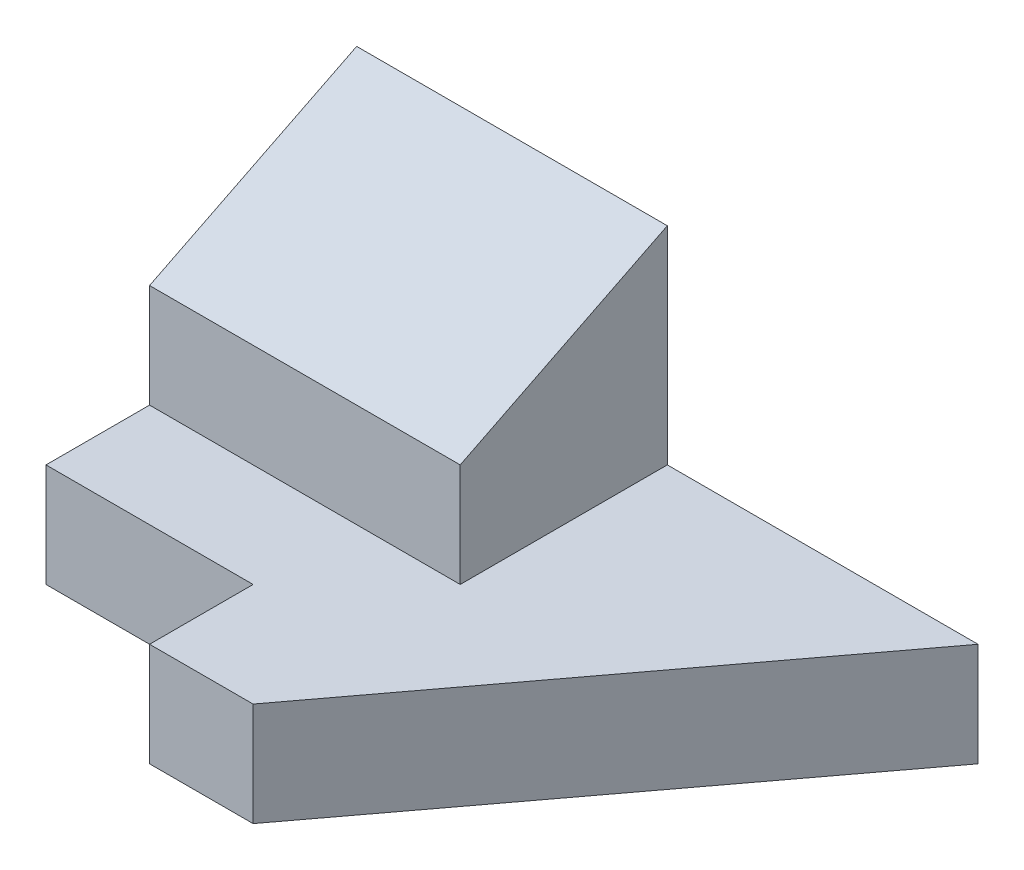
ISO-10303-21;
HEADER;
FILE_DESCRIPTION(('STEP AP214'),'2;1');
FILE_NAME('part.step','',(''),(''),'','','');
FILE_SCHEMA(('AUTOMOTIVE_DESIGN { 1 0 10303 214 1 1 1 1 }'));
ENDSEC;
DATA;
#1=APPLICATION_CONTEXT('core data for automotive mechanical design processes');
#2=APPLICATION_PROTOCOL_DEFINITION('international standard','automotive_design',2000,#1);
#3=PRODUCT_CONTEXT('',#1,'mechanical');
#4=PRODUCT('Part','Part','',(#3));
#5=PRODUCT_RELATED_PRODUCT_CATEGORY('part','',(#4));
#6=PRODUCT_DEFINITION_FORMATION('','',#4);
#7=PRODUCT_DEFINITION_CONTEXT('part definition',#1,'design');
#8=PRODUCT_DEFINITION('design','',#6,#7);
#9=PRODUCT_DEFINITION_SHAPE('','',#8);
#10=(LENGTH_UNIT() NAMED_UNIT(*) SI_UNIT(.MILLI.,.METRE.));
#11=(NAMED_UNIT(*) PLANE_ANGLE_UNIT() SI_UNIT($,.RADIAN.));
#12=(NAMED_UNIT(*) SI_UNIT($,.STERADIAN.) SOLID_ANGLE_UNIT());
#13=UNCERTAINTY_MEASURE_WITH_UNIT(LENGTH_MEASURE(1.E-05),#10,'distance_accuracy_value','');
#14=(GEOMETRIC_REPRESENTATION_CONTEXT(3) GLOBAL_UNCERTAINTY_ASSIGNED_CONTEXT((#13)) GLOBAL_UNIT_ASSIGNED_CONTEXT((#10,
#11,#12)) REPRESENTATION_CONTEXT('',''));
#15=CARTESIAN_POINT('',(0.,0.,0.));
#16=DIRECTION('',(0.,0.,1.));
#17=DIRECTION('',(1.,0.,0.));
#18=AXIS2_PLACEMENT_3D('',#15,#16,#17);
#19=CARTESIAN_POINT('',(0.,5.,-10.));
#20=DIRECTION('',(0.,0.,-1.));
#21=DIRECTION('',(-1.,0.,0.));
#22=AXIS2_PLACEMENT_3D('',#19,#20,#21);
#23=PLANE('',#22);
#24=DIRECTION('',(0.,-1.,0.));
#25=VECTOR('',#24,1.);
#26=CARTESIAN_POINT('',(15.,5.,-10.));
#27=LINE('',#26,#25);
#28=CARTESIAN_POINT('',(15.,5.,-10.));
#29=VERTEX_POINT('',#28);
#30=CARTESIAN_POINT('',(15.,0.,-10.));
#31=VERTEX_POINT('',#30);
#32=EDGE_CURVE('E137',#29,#31,#27,.T.);
#33=ORIENTED_EDGE('',*,*,#32,.T.);
#34=DIRECTION('',(1.,0.,0.));
#35=VECTOR('',#34,1.);
#36=CARTESIAN_POINT('',(0.,0.,-10.));
#37=LINE('',#36,#35);
#38=CARTESIAN_POINT('',(-15.,0.,-10.));
#39=VERTEX_POINT('',#38);
#40=EDGE_CURVE('E90',#39,#31,#37,.T.);
#41=ORIENTED_EDGE('',*,*,#40,.F.);
#42=DIRECTION('',(0.,-1.,0.));
#43=VECTOR('',#42,1.);
#44=CARTESIAN_POINT('',(-15.,5.,-10.));
#45=LINE('',#44,#43);
#46=CARTESIAN_POINT('',(-15.,15.,-10.));
#47=VERTEX_POINT('',#46);
#48=EDGE_CURVE('E11',#47,#39,#45,.T.);
#49=ORIENTED_EDGE('',*,*,#48,.F.);
#50=DIRECTION('',(1.,0.,0.));
#51=VECTOR('',#50,1.);
#52=CARTESIAN_POINT('',(0.,15.,-10.));
#53=LINE('',#52,#51);
#54=CARTESIAN_POINT('',(0.,15.,-10.));
#55=VERTEX_POINT('',#54);
#56=EDGE_CURVE('E180',#47,#55,#53,.T.);
#57=ORIENTED_EDGE('',*,*,#56,.T.);
#58=DIRECTION('',(0.,-1.,0.));
#59=VECTOR('',#58,1.);
#60=CARTESIAN_POINT('',(0.,15.,-10.));
#61=LINE('',#60,#59);
#62=CARTESIAN_POINT('',(0.,5.,-10.));
#63=VERTEX_POINT('',#62);
#64=EDGE_CURVE('E174',#55,#63,#61,.T.);
#65=ORIENTED_EDGE('',*,*,#64,.T.);
#66=DIRECTION('',(1.,0.,0.));
#67=VECTOR('',#66,1.);
#68=CARTESIAN_POINT('',(0.,5.,-10.));
#69=LINE('',#68,#67);
#70=EDGE_CURVE('E62',#63,#29,#69,.T.);
#71=ORIENTED_EDGE('',*,*,#70,.T.);
#72=EDGE_LOOP('',(#33,#41,#49,#57,#65,#71));
#73=FACE_BOUND('',#72,.T.);
#74=ADVANCED_FACE('F39',(#73),#23,.T.);
#75=CARTESIAN_POINT('',(-15.,5.,0.));
#76=DIRECTION('',(-1.,0.,0.));
#77=DIRECTION('',(0.,0.,1.));
#78=AXIS2_PLACEMENT_3D('',#75,#76,#77);
#79=PLANE('',#78);
#80=DIRECTION('',(0.,0.447213595499958,-0.894427190999916));
#81=VECTOR('',#80,1.);
#82=CARTESIAN_POINT('',(-15.,15.,-10.));
#83=LINE('',#82,#81);
#84=CARTESIAN_POINT('',(-15.,10.,0.));
#85=VERTEX_POINT('',#84);
#86=EDGE_CURVE('E162',#85,#47,#83,.T.);
#87=ORIENTED_EDGE('',*,*,#86,.T.);
#88=ORIENTED_EDGE('',*,*,#48,.T.);
#89=DIRECTION('',(0.,0.,-1.));
#90=VECTOR('',#89,1.);
#91=CARTESIAN_POINT('',(-15.,0.,0.));
#92=LINE('',#91,#90);
#93=CARTESIAN_POINT('',(-15.,0.,5.));
#94=VERTEX_POINT('',#93);
#95=EDGE_CURVE('E139',#94,#39,#92,.T.);
#96=ORIENTED_EDGE('',*,*,#95,.F.);
#97=DIRECTION('',(0.,-1.,0.));
#98=VECTOR('',#97,1.);
#99=CARTESIAN_POINT('',(-15.,5.,5.));
#100=LINE('',#99,#98);
#101=CARTESIAN_POINT('',(-15.,5.,5.));
#102=VERTEX_POINT('',#101);
#103=EDGE_CURVE('E46',#102,#94,#100,.T.);
#104=ORIENTED_EDGE('',*,*,#103,.F.);
#105=DIRECTION('',(0.,0.,-1.));
#106=VECTOR('',#105,1.);
#107=CARTESIAN_POINT('',(-15.,5.,0.));
#108=LINE('',#107,#106);
#109=CARTESIAN_POINT('',(-15.,5.,0.));
#110=VERTEX_POINT('',#109);
#111=EDGE_CURVE('E132',#102,#110,#108,.T.);
#112=ORIENTED_EDGE('',*,*,#111,.T.);
#113=DIRECTION('',(0.,-1.,0.));
#114=VECTOR('',#113,1.);
#115=CARTESIAN_POINT('',(-15.,15.,0.));
#116=LINE('',#115,#114);
#117=EDGE_CURVE('E53',#85,#110,#116,.T.);
#118=ORIENTED_EDGE('',*,*,#117,.F.);
#119=EDGE_LOOP('',(#87,#88,#96,#104,#112,#118));
#120=FACE_BOUND('',#119,.T.);
#121=ADVANCED_FACE('F158',(#120),#79,.T.);
#122=CARTESIAN_POINT('',(0.,5.,5.));
#123=DIRECTION('',(0.,0.,-1.));
#124=DIRECTION('',(-1.,0.,0.));
#125=AXIS2_PLACEMENT_3D('',#122,#123,#124);
#126=PLANE('',#125);
#127=DIRECTION('',(1.,0.,0.));
#128=VECTOR('',#127,1.);
#129=CARTESIAN_POINT('',(0.,0.,5.));
#130=LINE('',#129,#128);
#131=CARTESIAN_POINT('',(-5.,0.,5.));
#132=VERTEX_POINT('',#131);
#133=EDGE_CURVE('E142',#94,#132,#130,.T.);
#134=ORIENTED_EDGE('',*,*,#133,.T.);
#135=DIRECTION('',(0.,-1.,0.));
#136=VECTOR('',#135,1.);
#137=CARTESIAN_POINT('',(-5.,5.,5.));
#138=LINE('',#137,#136);
#139=CARTESIAN_POINT('',(-5.,5.,5.));
#140=VERTEX_POINT('',#139);
#141=EDGE_CURVE('E115',#140,#132,#138,.T.);
#142=ORIENTED_EDGE('',*,*,#141,.F.);
#143=DIRECTION('',(1.,0.,0.));
#144=VECTOR('',#143,1.);
#145=CARTESIAN_POINT('',(0.,5.,5.));
#146=LINE('',#145,#144);
#147=EDGE_CURVE('E129',#102,#140,#146,.T.);
#148=ORIENTED_EDGE('',*,*,#147,.F.);
#149=ORIENTED_EDGE('',*,*,#103,.T.);
#150=EDGE_LOOP('',(#134,#142,#148,#149));
#151=FACE_BOUND('',#150,.T.);
#152=ADVANCED_FACE('F155',(#151),#126,.F.);
#153=CARTESIAN_POINT('',(-5.,5.,0.));
#154=DIRECTION('',(-1.,0.,0.));
#155=DIRECTION('',(0.,0.,1.));
#156=AXIS2_PLACEMENT_3D('',#153,#154,#155);
#157=PLANE('',#156);
#158=DIRECTION('',(0.,0.,-1.));
#159=VECTOR('',#158,1.);
#160=CARTESIAN_POINT('',(-5.,0.,0.));
#161=LINE('',#160,#159);
#162=CARTESIAN_POINT('',(-5.,0.,10.));
#163=VERTEX_POINT('',#162);
#164=EDGE_CURVE('E112',#163,#132,#161,.T.);
#165=ORIENTED_EDGE('',*,*,#164,.F.);
#166=DIRECTION('',(0.,-1.,0.));
#167=VECTOR('',#166,1.);
#168=CARTESIAN_POINT('',(-5.,5.,10.));
#169=LINE('',#168,#167);
#170=CARTESIAN_POINT('',(-5.,5.,10.));
#171=VERTEX_POINT('',#170);
#172=EDGE_CURVE('E106',#171,#163,#169,.T.);
#173=ORIENTED_EDGE('',*,*,#172,.F.);
#174=DIRECTION('',(0.,0.,-1.));
#175=VECTOR('',#174,1.);
#176=CARTESIAN_POINT('',(-5.,5.,0.));
#177=LINE('',#176,#175);
#178=EDGE_CURVE('E110',#171,#140,#177,.T.);
#179=ORIENTED_EDGE('',*,*,#178,.T.);
#180=ORIENTED_EDGE('',*,*,#141,.T.);
#181=EDGE_LOOP('',(#165,#173,#179,#180));
#182=FACE_BOUND('',#181,.T.);
#183=ADVANCED_FACE('F108',(#182),#157,.T.);
#184=CARTESIAN_POINT('',(0.,5.,10.));
#185=DIRECTION('',(0.,0.,-1.));
#186=DIRECTION('',(-1.,0.,0.));
#187=AXIS2_PLACEMENT_3D('',#184,#185,#186);
#188=PLANE('',#187);
#189=DIRECTION('',(1.,0.,0.));
#190=VECTOR('',#189,1.);
#191=CARTESIAN_POINT('',(0.,0.,10.));
#192=LINE('',#191,#190);
#193=CARTESIAN_POINT('',(0.,0.,10.));
#194=VERTEX_POINT('',#193);
#195=EDGE_CURVE('E146',#163,#194,#192,.T.);
#196=ORIENTED_EDGE('',*,*,#195,.T.);
#197=DIRECTION('',(0.,-1.,0.));
#198=VECTOR('',#197,1.);
#199=CARTESIAN_POINT('',(0.,5.,10.));
#200=LINE('',#199,#198);
#201=CARTESIAN_POINT('',(0.,5.,10.));
#202=VERTEX_POINT('',#201);
#203=EDGE_CURVE('E116',#202,#194,#200,.T.);
#204=ORIENTED_EDGE('',*,*,#203,.F.);
#205=DIRECTION('',(1.,0.,0.));
#206=VECTOR('',#205,1.);
#207=CARTESIAN_POINT('',(0.,5.,10.));
#208=LINE('',#207,#206);
#209=EDGE_CURVE('E119',#171,#202,#208,.T.);
#210=ORIENTED_EDGE('',*,*,#209,.F.);
#211=ORIENTED_EDGE('',*,*,#172,.T.);
#212=EDGE_LOOP('',(#196,#204,#210,#211));
#213=FACE_BOUND('',#212,.T.);
#214=ADVANCED_FACE('F120',(#213),#188,.F.);
#215=CARTESIAN_POINT('',(4.8,5.,3.6));
#216=DIRECTION('',(-0.8,0.,-0.6));
#217=DIRECTION('',(-0.6,0.,0.8));
#218=AXIS2_PLACEMENT_3D('',#215,#216,#217);
#219=PLANE('',#218);
#220=DIRECTION('',(0.6,0.,-0.8));
#221=VECTOR('',#220,1.);
#222=CARTESIAN_POINT('',(4.8,0.,3.6));
#223=LINE('',#222,#221);
#224=EDGE_CURVE('E148',#194,#31,#223,.T.);
#225=ORIENTED_EDGE('',*,*,#224,.T.);
#226=ORIENTED_EDGE('',*,*,#32,.F.);
#227=DIRECTION('',(0.6,0.,-0.8));
#228=VECTOR('',#227,1.);
#229=CARTESIAN_POINT('',(4.8,5.,3.6));
#230=LINE('',#229,#228);
#231=EDGE_CURVE('E124',#202,#29,#230,.T.);
#232=ORIENTED_EDGE('',*,*,#231,.F.);
#233=ORIENTED_EDGE('',*,*,#203,.T.);
#234=EDGE_LOOP('',(#225,#226,#232,#233));
#235=FACE_BOUND('',#234,.T.);
#236=ADVANCED_FACE('F166',(#235),#219,.F.);
#237=CARTESIAN_POINT('',(0.,5.,0.));
#238=DIRECTION('',(0.,1.,0.));
#239=DIRECTION('',(0.,0.,1.));
#240=AXIS2_PLACEMENT_3D('',#237,#238,#239);
#241=PLANE('',#240);
#242=DIRECTION('',(0.,0.,-1.));
#243=VECTOR('',#242,1.);
#244=CARTESIAN_POINT('',(0.,5.,0.));
#245=LINE('',#244,#243);
#246=CARTESIAN_POINT('',(0.,5.,0.));
#247=VERTEX_POINT('',#246);
#248=EDGE_CURVE('E140',#247,#63,#245,.T.);
#249=ORIENTED_EDGE('',*,*,#248,.F.);
#250=DIRECTION('',(-1.,0.,0.));
#251=VECTOR('',#250,1.);
#252=CARTESIAN_POINT('',(0.,5.,0.));
#253=LINE('',#252,#251);
#254=EDGE_CURVE('E172',#247,#110,#253,.T.);
#255=ORIENTED_EDGE('',*,*,#254,.T.);
#256=ORIENTED_EDGE('',*,*,#111,.F.);
#257=ORIENTED_EDGE('',*,*,#147,.T.);
#258=ORIENTED_EDGE('',*,*,#178,.F.);
#259=ORIENTED_EDGE('',*,*,#209,.T.);
#260=ORIENTED_EDGE('',*,*,#231,.T.);
#261=ORIENTED_EDGE('',*,*,#70,.F.);
#262=EDGE_LOOP('',(#249,#255,#256,#257,#258,#259,#260,#261));
#263=FACE_BOUND('',#262,.T.);
#264=ADVANCED_FACE('F127',(#263),#241,.T.);
#265=CARTESIAN_POINT('',(0.,0.,0.));
#266=DIRECTION('',(0.,1.,0.));
#267=DIRECTION('',(0.,0.,1.));
#268=AXIS2_PLACEMENT_3D('',#265,#266,#267);
#269=PLANE('',#268);
#270=ORIENTED_EDGE('',*,*,#40,.T.);
#271=ORIENTED_EDGE('',*,*,#224,.F.);
#272=ORIENTED_EDGE('',*,*,#195,.F.);
#273=ORIENTED_EDGE('',*,*,#164,.T.);
#274=ORIENTED_EDGE('',*,*,#133,.F.);
#275=ORIENTED_EDGE('',*,*,#95,.T.);
#276=EDGE_LOOP('',(#270,#271,#272,#273,#274,#275));
#277=FACE_BOUND('',#276,.T.);
#278=ADVANCED_FACE('F156',(#277),#269,.F.);
#279=CARTESIAN_POINT('',(0.,15.,0.));
#280=DIRECTION('',(1.,0.,0.));
#281=DIRECTION('',(0.,0.,-1.));
#282=AXIS2_PLACEMENT_3D('',#279,#280,#281);
#283=PLANE('',#282);
#284=DIRECTION('',(0.,0.447213595499958,-0.894427190999916));
#285=VECTOR('',#284,1.);
#286=CARTESIAN_POINT('',(0.,15.,-10.));
#287=LINE('',#286,#285);
#288=CARTESIAN_POINT('',(0.,10.,0.));
#289=VERTEX_POINT('',#288);
#290=EDGE_CURVE('E185',#289,#55,#287,.T.);
#291=ORIENTED_EDGE('',*,*,#290,.F.);
#292=DIRECTION('',(0.,-1.,0.));
#293=VECTOR('',#292,1.);
#294=CARTESIAN_POINT('',(0.,15.,0.));
#295=LINE('',#294,#293);
#296=EDGE_CURVE('E177',#289,#247,#295,.T.);
#297=ORIENTED_EDGE('',*,*,#296,.T.);
#298=ORIENTED_EDGE('',*,*,#248,.T.);
#299=ORIENTED_EDGE('',*,*,#64,.F.);
#300=EDGE_LOOP('',(#291,#297,#298,#299));
#301=FACE_BOUND('',#300,.T.);
#302=ADVANCED_FACE('F198',(#301),#283,.T.);
#303=CARTESIAN_POINT('',(0.,15.,0.));
#304=DIRECTION('',(0.,0.,-1.));
#305=DIRECTION('',(-1.,0.,0.));
#306=AXIS2_PLACEMENT_3D('',#303,#304,#305);
#307=PLANE('',#306);
#308=ORIENTED_EDGE('',*,*,#296,.F.);
#309=DIRECTION('',(1.,0.,0.));
#310=VECTOR('',#309,1.);
#311=CARTESIAN_POINT('',(-15.,10.,0.));
#312=LINE('',#311,#310);
#313=EDGE_CURVE('E182',#85,#289,#312,.T.);
#314=ORIENTED_EDGE('',*,*,#313,.F.);
#315=ORIENTED_EDGE('',*,*,#117,.T.);
#316=ORIENTED_EDGE('',*,*,#254,.F.);
#317=EDGE_LOOP('',(#308,#314,#315,#316));
#318=FACE_BOUND('',#317,.T.);
#319=ADVANCED_FACE('F199',(#318),#307,.F.);
#320=CARTESIAN_POINT('',(-15.,15.,-10.));
#321=DIRECTION('',(0.,-0.894427190999916,-0.447213595499958));
#322=DIRECTION('',(0.,0.447213595499958,-0.894427190999916));
#323=AXIS2_PLACEMENT_3D('',#320,#321,#322);
#324=PLANE('',#323);
#325=ORIENTED_EDGE('',*,*,#290,.T.);
#326=ORIENTED_EDGE('',*,*,#56,.F.);
#327=ORIENTED_EDGE('',*,*,#86,.F.);
#328=ORIENTED_EDGE('',*,*,#313,.T.);
#329=EDGE_LOOP('',(#325,#326,#327,#328));
#330=FACE_BOUND('',#329,.T.);
#331=ADVANCED_FACE('F193',(#330),#324,.F.);
#332=CLOSED_SHELL('',(#74,#121,#152,#183,#214,#236,#264,#278,#302,#319,#331));
#333=MANIFOLD_SOLID_BREP('B2',#332);
#334=ADVANCED_BREP_SHAPE_REPRESENTATION('',(#18,#333),#14);
#335=SHAPE_DEFINITION_REPRESENTATION(#9,#334);
ENDSEC;
END-ISO-10303-21;
